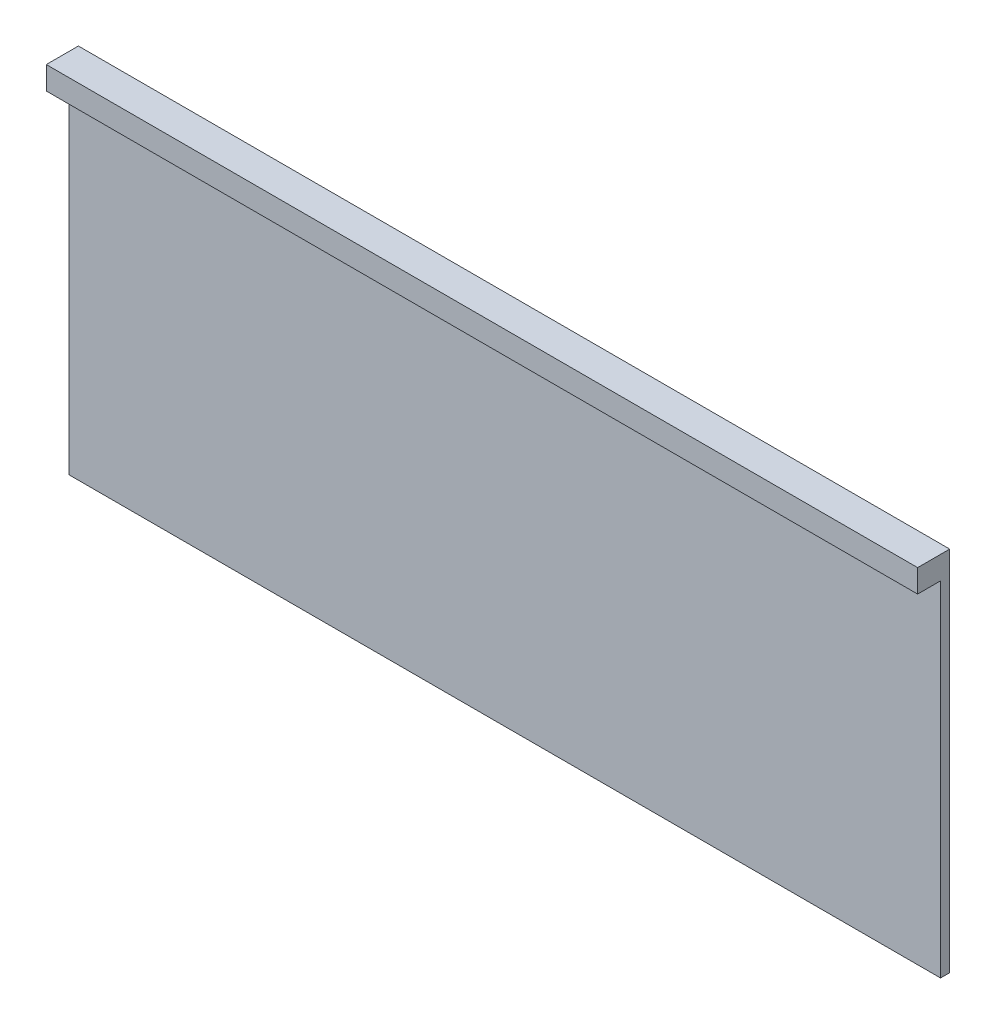
ISO-10303-21;
HEADER;
FILE_DESCRIPTION(('STEP AP214'),'2;1');
FILE_NAME('part.step','',(''),(''),'','','');
FILE_SCHEMA(('AUTOMOTIVE_DESIGN { 1 0 10303 214 1 1 1 1 }'));
ENDSEC;
DATA;
#1=APPLICATION_CONTEXT('core data for automotive mechanical design processes');
#2=APPLICATION_PROTOCOL_DEFINITION('international standard','automotive_design',2000,#1);
#3=PRODUCT_CONTEXT('',#1,'mechanical');
#4=PRODUCT('Part','Part','',(#3));
#5=PRODUCT_RELATED_PRODUCT_CATEGORY('part','',(#4));
#6=PRODUCT_DEFINITION_FORMATION('','',#4);
#7=PRODUCT_DEFINITION_CONTEXT('part definition',#1,'design');
#8=PRODUCT_DEFINITION('design','',#6,#7);
#9=PRODUCT_DEFINITION_SHAPE('','',#8);
#10=(LENGTH_UNIT() NAMED_UNIT(*) SI_UNIT(.MILLI.,.METRE.));
#11=(NAMED_UNIT(*) PLANE_ANGLE_UNIT() SI_UNIT($,.RADIAN.));
#12=(NAMED_UNIT(*) SI_UNIT($,.STERADIAN.) SOLID_ANGLE_UNIT());
#13=UNCERTAINTY_MEASURE_WITH_UNIT(LENGTH_MEASURE(1.E-05),#10,'distance_accuracy_value','');
#14=(GEOMETRIC_REPRESENTATION_CONTEXT(3) GLOBAL_UNCERTAINTY_ASSIGNED_CONTEXT((#13)) GLOBAL_UNIT_ASSIGNED_CONTEXT((#10,
#11,#12)) REPRESENTATION_CONTEXT('',''));
#15=CARTESIAN_POINT('',(0.,0.,0.));
#16=DIRECTION('',(0.,0.,1.));
#17=DIRECTION('',(1.,0.,0.));
#18=AXIS2_PLACEMENT_3D('',#15,#16,#17);
#19=CARTESIAN_POINT('',(-76.,30.,0.8));
#20=DIRECTION('',(1.,0.,0.));
#21=DIRECTION('',(0.,0.,-1.));
#22=AXIS2_PLACEMENT_3D('',#19,#20,#21);
#23=PLANE('',#22);
#24=DIRECTION('',(0.,-1.,0.));
#25=VECTOR('',#24,1.);
#26=CARTESIAN_POINT('',(-76.,30.,0.));
#27=LINE('',#26,#25);
#28=CARTESIAN_POINT('',(-76.,30.,0.));
#29=VERTEX_POINT('',#28);
#30=CARTESIAN_POINT('',(-76.,-2.,0.));
#31=VERTEX_POINT('',#30);
#32=EDGE_CURVE('E91',#29,#31,#27,.T.);
#33=ORIENTED_EDGE('',*,*,#32,.T.);
#34=DIRECTION('',(0.,0.,-1.));
#35=VECTOR('',#34,1.);
#36=CARTESIAN_POINT('',(-76.,-2.,0.8));
#37=LINE('',#36,#35);
#38=CARTESIAN_POINT('',(-76.,-2.,0.8));
#39=VERTEX_POINT('',#38);
#40=EDGE_CURVE('E11',#39,#31,#37,.T.);
#41=ORIENTED_EDGE('',*,*,#40,.F.);
#42=DIRECTION('',(0.,-1.,0.));
#43=VECTOR('',#42,1.);
#44=CARTESIAN_POINT('',(-76.,30.,0.8));
#45=LINE('',#44,#43);
#46=CARTESIAN_POINT('',(-76.,28.,0.8));
#47=VERTEX_POINT('',#46);
#48=EDGE_CURVE('E84',#47,#39,#45,.T.);
#49=ORIENTED_EDGE('',*,*,#48,.F.);
#50=DIRECTION('',(0.,0.,-1.));
#51=VECTOR('',#50,1.);
#52=CARTESIAN_POINT('',(-76.,28.,2.8));
#53=LINE('',#52,#51);
#54=CARTESIAN_POINT('',(-76.,28.,2.8));
#55=VERTEX_POINT('',#54);
#56=EDGE_CURVE('E99',#55,#47,#53,.T.);
#57=ORIENTED_EDGE('',*,*,#56,.F.);
#58=DIRECTION('',(0.,-1.,0.));
#59=VECTOR('',#58,1.);
#60=CARTESIAN_POINT('',(-76.,30.,2.8));
#61=LINE('',#60,#59);
#62=CARTESIAN_POINT('',(-76.,30.,2.8));
#63=VERTEX_POINT('',#62);
#64=EDGE_CURVE('E94',#63,#55,#61,.T.);
#65=ORIENTED_EDGE('',*,*,#64,.F.);
#66=DIRECTION('',(0.,0.,-1.));
#67=VECTOR('',#66,1.);
#68=CARTESIAN_POINT('',(-76.,30.,0.8));
#69=LINE('',#68,#67);
#70=EDGE_CURVE('E77',#63,#29,#69,.T.);
#71=ORIENTED_EDGE('',*,*,#70,.T.);
#72=EDGE_LOOP('',(#33,#41,#49,#57,#65,#71));
#73=FACE_BOUND('',#72,.T.);
#74=ADVANCED_FACE('F33',(#73),#23,.F.);
#75=CARTESIAN_POINT('',(-76.,-2.,0.8));
#76=DIRECTION('',(0.,1.,0.));
#77=DIRECTION('',(0.,0.,1.));
#78=AXIS2_PLACEMENT_3D('',#75,#76,#77);
#79=PLANE('',#78);
#80=DIRECTION('',(1.,0.,0.));
#81=VECTOR('',#80,1.);
#82=CARTESIAN_POINT('',(-76.,-2.,0.));
#83=LINE('',#82,#81);
#84=CARTESIAN_POINT('',(0.,-2.,0.));
#85=VERTEX_POINT('',#84);
#86=EDGE_CURVE('E98',#31,#85,#83,.T.);
#87=ORIENTED_EDGE('',*,*,#86,.T.);
#88=DIRECTION('',(0.,0.,-1.));
#89=VECTOR('',#88,1.);
#90=CARTESIAN_POINT('',(0.,-2.,0.8));
#91=LINE('',#90,#89);
#92=CARTESIAN_POINT('',(0.,-2.,0.8));
#93=VERTEX_POINT('',#92);
#94=EDGE_CURVE('E40',#93,#85,#91,.T.);
#95=ORIENTED_EDGE('',*,*,#94,.F.);
#96=DIRECTION('',(1.,0.,0.));
#97=VECTOR('',#96,1.);
#98=CARTESIAN_POINT('',(-76.,-2.,0.8));
#99=LINE('',#98,#97);
#100=EDGE_CURVE('E53',#39,#93,#99,.T.);
#101=ORIENTED_EDGE('',*,*,#100,.F.);
#102=ORIENTED_EDGE('',*,*,#40,.T.);
#103=EDGE_LOOP('',(#87,#95,#101,#102));
#104=FACE_BOUND('',#103,.T.);
#105=ADVANCED_FACE('F115',(#104),#79,.F.);
#106=CARTESIAN_POINT('',(0.,30.,0.8));
#107=DIRECTION('',(-1.,0.,0.));
#108=DIRECTION('',(0.,-1.,0.));
#109=AXIS2_PLACEMENT_3D('',#106,#107,#108);
#110=PLANE('',#109);
#111=DIRECTION('',(0.,1.,0.));
#112=VECTOR('',#111,1.);
#113=CARTESIAN_POINT('',(0.,30.,0.));
#114=LINE('',#113,#112);
#115=CARTESIAN_POINT('',(0.,30.,0.));
#116=VERTEX_POINT('',#115);
#117=EDGE_CURVE('E85',#85,#116,#114,.T.);
#118=ORIENTED_EDGE('',*,*,#117,.T.);
#119=DIRECTION('',(0.,0.,-1.));
#120=VECTOR('',#119,1.);
#121=CARTESIAN_POINT('',(0.,30.,0.8));
#122=LINE('',#121,#120);
#123=CARTESIAN_POINT('',(0.,30.,2.8));
#124=VERTEX_POINT('',#123);
#125=EDGE_CURVE('E80',#124,#116,#122,.T.);
#126=ORIENTED_EDGE('',*,*,#125,.F.);
#127=DIRECTION('',(0.,1.,0.));
#128=VECTOR('',#127,1.);
#129=CARTESIAN_POINT('',(0.,30.,2.8));
#130=LINE('',#129,#128);
#131=CARTESIAN_POINT('',(0.,28.,2.8));
#132=VERTEX_POINT('',#131);
#133=EDGE_CURVE('E130',#132,#124,#130,.T.);
#134=ORIENTED_EDGE('',*,*,#133,.F.);
#135=DIRECTION('',(0.,0.,-1.));
#136=VECTOR('',#135,1.);
#137=CARTESIAN_POINT('',(0.,28.,2.8));
#138=LINE('',#137,#136);
#139=CARTESIAN_POINT('',(0.,28.,0.8));
#140=VERTEX_POINT('',#139);
#141=EDGE_CURVE('E103',#132,#140,#138,.T.);
#142=ORIENTED_EDGE('',*,*,#141,.T.);
#143=DIRECTION('',(0.,1.,0.));
#144=VECTOR('',#143,1.);
#145=CARTESIAN_POINT('',(0.,30.,0.8));
#146=LINE('',#145,#144);
#147=EDGE_CURVE('E95',#93,#140,#146,.T.);
#148=ORIENTED_EDGE('',*,*,#147,.F.);
#149=ORIENTED_EDGE('',*,*,#94,.T.);
#150=EDGE_LOOP('',(#118,#126,#134,#142,#148,#149));
#151=FACE_BOUND('',#150,.T.);
#152=ADVANCED_FACE('F112',(#151),#110,.F.);
#153=CARTESIAN_POINT('',(-76.,30.,0.8));
#154=DIRECTION('',(0.,-1.,0.));
#155=DIRECTION('',(0.,0.,-1.));
#156=AXIS2_PLACEMENT_3D('',#153,#154,#155);
#157=PLANE('',#156);
#158=DIRECTION('',(-1.,0.,0.));
#159=VECTOR('',#158,1.);
#160=CARTESIAN_POINT('',(-76.,30.,0.));
#161=LINE('',#160,#159);
#162=EDGE_CURVE('E73',#116,#29,#161,.T.);
#163=ORIENTED_EDGE('',*,*,#162,.T.);
#164=ORIENTED_EDGE('',*,*,#70,.F.);
#165=DIRECTION('',(-1.,0.,0.));
#166=VECTOR('',#165,1.);
#167=CARTESIAN_POINT('',(-76.,30.,2.8));
#168=LINE('',#167,#166);
#169=EDGE_CURVE('E133',#124,#63,#168,.T.);
#170=ORIENTED_EDGE('',*,*,#169,.F.);
#171=ORIENTED_EDGE('',*,*,#125,.T.);
#172=EDGE_LOOP('',(#163,#164,#170,#171));
#173=FACE_BOUND('',#172,.T.);
#174=ADVANCED_FACE('F75',(#173),#157,.F.);
#175=CARTESIAN_POINT('',(0.,0.,0.8));
#176=DIRECTION('',(0.,0.,1.));
#177=DIRECTION('',(1.,0.,0.));
#178=AXIS2_PLACEMENT_3D('',#175,#176,#177);
#179=PLANE('',#178);
#180=DIRECTION('',(1.,0.,0.));
#181=VECTOR('',#180,1.);
#182=CARTESIAN_POINT('',(-76.,28.,0.8));
#183=LINE('',#182,#181);
#184=EDGE_CURVE('E47',#47,#140,#183,.T.);
#185=ORIENTED_EDGE('',*,*,#184,.F.);
#186=ORIENTED_EDGE('',*,*,#48,.T.);
#187=ORIENTED_EDGE('',*,*,#100,.T.);
#188=ORIENTED_EDGE('',*,*,#147,.T.);
#189=EDGE_LOOP('',(#185,#186,#187,#188));
#190=FACE_BOUND('',#189,.T.);
#191=ADVANCED_FACE('F139',(#190),#179,.T.);
#192=CARTESIAN_POINT('',(0.,0.,0.));
#193=DIRECTION('',(0.,0.,1.));
#194=DIRECTION('',(1.,0.,0.));
#195=AXIS2_PLACEMENT_3D('',#192,#193,#194);
#196=PLANE('',#195);
#197=ORIENTED_EDGE('',*,*,#32,.F.);
#198=ORIENTED_EDGE('',*,*,#162,.F.);
#199=ORIENTED_EDGE('',*,*,#117,.F.);
#200=ORIENTED_EDGE('',*,*,#86,.F.);
#201=EDGE_LOOP('',(#197,#198,#199,#200));
#202=FACE_BOUND('',#201,.T.);
#203=ADVANCED_FACE('F97',(#202),#196,.F.);
#204=CARTESIAN_POINT('',(-76.,28.,2.8));
#205=DIRECTION('',(0.,1.,0.));
#206=DIRECTION('',(0.,0.,1.));
#207=AXIS2_PLACEMENT_3D('',#204,#205,#206);
#208=PLANE('',#207);
#209=ORIENTED_EDGE('',*,*,#184,.T.);
#210=ORIENTED_EDGE('',*,*,#141,.F.);
#211=DIRECTION('',(1.,0.,0.));
#212=VECTOR('',#211,1.);
#213=CARTESIAN_POINT('',(-76.,28.,2.8));
#214=LINE('',#213,#212);
#215=EDGE_CURVE('E124',#55,#132,#214,.T.);
#216=ORIENTED_EDGE('',*,*,#215,.F.);
#217=ORIENTED_EDGE('',*,*,#56,.T.);
#218=EDGE_LOOP('',(#209,#210,#216,#217));
#219=FACE_BOUND('',#218,.T.);
#220=ADVANCED_FACE('F120',(#219),#208,.F.);
#221=CARTESIAN_POINT('',(0.,0.,2.8));
#222=DIRECTION('',(0.,0.,1.));
#223=DIRECTION('',(1.,0.,0.));
#224=AXIS2_PLACEMENT_3D('',#221,#222,#223);
#225=PLANE('',#224);
#226=ORIENTED_EDGE('',*,*,#64,.T.);
#227=ORIENTED_EDGE('',*,*,#215,.T.);
#228=ORIENTED_EDGE('',*,*,#133,.T.);
#229=ORIENTED_EDGE('',*,*,#169,.T.);
#230=EDGE_LOOP('',(#226,#227,#228,#229));
#231=FACE_BOUND('',#230,.T.);
#232=ADVANCED_FACE('F132',(#231),#225,.T.);
#233=CLOSED_SHELL('',(#74,#105,#152,#174,#191,#203,#220,#232));
#234=MANIFOLD_SOLID_BREP('B2',#233);
#235=ADVANCED_BREP_SHAPE_REPRESENTATION('',(#18,#234),#14);
#236=SHAPE_DEFINITION_REPRESENTATION(#9,#235);
ENDSEC;
END-ISO-10303-21;
